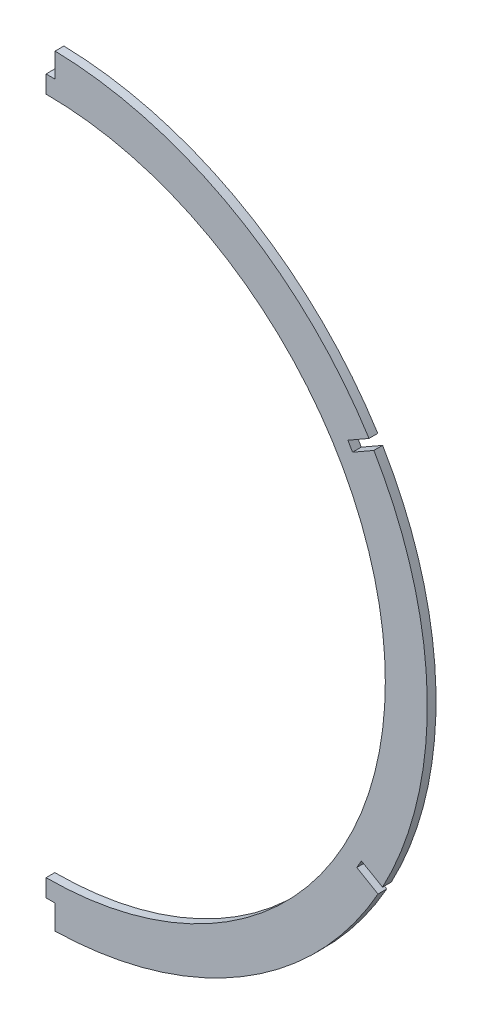
ISO-10303-21;
HEADER;
FILE_DESCRIPTION(('STEP AP214'),'2;1');
FILE_NAME('part.step','',(''),(''),'','','');
FILE_SCHEMA(('AUTOMOTIVE_DESIGN { 1 0 10303 214 1 1 1 1 }'));
ENDSEC;
DATA;
#1=APPLICATION_CONTEXT('core data for automotive mechanical design processes');
#2=APPLICATION_PROTOCOL_DEFINITION('international standard','automotive_design',2000,#1);
#3=PRODUCT_CONTEXT('',#1,'mechanical');
#4=PRODUCT('Part','Part','',(#3));
#5=PRODUCT_RELATED_PRODUCT_CATEGORY('part','',(#4));
#6=PRODUCT_DEFINITION_FORMATION('','',#4);
#7=PRODUCT_DEFINITION_CONTEXT('part definition',#1,'design');
#8=PRODUCT_DEFINITION('design','',#6,#7);
#9=PRODUCT_DEFINITION_SHAPE('','',#8);
#10=(LENGTH_UNIT() NAMED_UNIT(*) SI_UNIT(.MILLI.,.METRE.));
#11=(NAMED_UNIT(*) PLANE_ANGLE_UNIT() SI_UNIT($,.RADIAN.));
#12=(NAMED_UNIT(*) SI_UNIT($,.STERADIAN.) SOLID_ANGLE_UNIT());
#13=UNCERTAINTY_MEASURE_WITH_UNIT(LENGTH_MEASURE(1.E-05),#10,'distance_accuracy_value','');
#14=(GEOMETRIC_REPRESENTATION_CONTEXT(3) GLOBAL_UNCERTAINTY_ASSIGNED_CONTEXT((#13)) GLOBAL_UNIT_ASSIGNED_CONTEXT((#10,
#11,#12)) REPRESENTATION_CONTEXT('',''));
#15=CARTESIAN_POINT('',(0.,0.,0.));
#16=DIRECTION('',(0.,0.,1.));
#17=DIRECTION('',(1.,0.,0.));
#18=AXIS2_PLACEMENT_3D('',#15,#16,#17);
#19=CARTESIAN_POINT('',(0.,21.844,1.5875));
#20=DIRECTION('',(0.,0.,-1.));
#21=DIRECTION('',(-1.,0.,0.));
#22=AXIS2_PLACEMENT_3D('',#19,#20,#21);
#23=CYLINDRICAL_SURFACE('',#22,138.43);
#24=DIRECTION('',(0.,0.,-1.));
#25=VECTOR('',#24,1.);
#26=CARTESIAN_POINT('',(3.30200000000003,160.234612745229,1.58750000000002));
#27=LINE('',#26,#25);
#28=CARTESIAN_POINT('',(3.30200000000003,160.234612745229,1.58750000000002));
#29=VERTEX_POINT('',#28);
#30=CARTESIAN_POINT('',(3.30200000000003,160.234612745229,-1.5875));
#31=VERTEX_POINT('',#30);
#32=EDGE_CURVE('E177',#29,#31,#27,.T.);
#33=ORIENTED_EDGE('',*,*,#32,.F.);
#34=CARTESIAN_POINT('',(0.,21.844,1.5875));
#35=DIRECTION('',(0.,0.,1.));
#36=DIRECTION('',(1.,0.,0.));
#37=AXIS2_PLACEMENT_3D('',#34,#35,#36);
#38=CIRCLE('',#37,138.43);
#39=CARTESIAN_POINT('',(117.267867628689,95.4042618389861,1.58750000000002));
#40=VERTEX_POINT('',#39);
#41=EDGE_CURVE('E253',#40,#29,#38,.T.);
#42=ORIENTED_EDGE('',*,*,#41,.F.);
#43=DIRECTION('',(0.,0.,-1.));
#44=VECTOR('',#43,1.);
#45=CARTESIAN_POINT('',(117.267867628689,95.4042618389861,1.58750000000002));
#46=LINE('',#45,#44);
#47=CARTESIAN_POINT('',(117.267867628689,95.4042618389861,-1.5875));
#48=VERTEX_POINT('',#47);
#49=EDGE_CURVE('E154',#40,#48,#46,.T.);
#50=ORIENTED_EDGE('',*,*,#49,.T.);
#51=CARTESIAN_POINT('',(0.,21.844,-1.5875));
#52=DIRECTION('',(0.,0.,1.));
#53=DIRECTION('',(1.,0.,0.));
#54=AXIS2_PLACEMENT_3D('',#51,#52,#53);
#55=CIRCLE('',#54,138.43);
#56=EDGE_CURVE('E249',#48,#31,#55,.T.);
#57=ORIENTED_EDGE('',*,*,#56,.T.);
#58=EDGE_LOOP('',(#33,#42,#50,#57));
#59=FACE_BOUND('',#58,.T.);
#60=ADVANCED_FACE('F36',(#59),#23,.T.);
#61=DIRECTION('',(0.,0.,-1.));
#62=VECTOR('',#61,1.);
#63=CARTESIAN_POINT('',(119.028614444151,92.5196948569,1.58750000000002));
#64=LINE('',#63,#62);
#65=CARTESIAN_POINT('',(119.028614444151,92.5196948569,1.58750000000002));
#66=VERTEX_POINT('',#65);
#67=CARTESIAN_POINT('',(119.028614444151,92.5196948569,-1.5875));
#68=VERTEX_POINT('',#67);
#69=EDGE_CURVE('E181',#66,#68,#64,.T.);
#70=ORIENTED_EDGE('',*,*,#69,.F.);
#71=CARTESIAN_POINT('',(122.170481646894,-43.2500728036427,1.58750000000002));
#72=VERTEX_POINT('',#71);
#73=EDGE_CURVE('E255',#72,#66,#38,.T.);
#74=ORIENTED_EDGE('',*,*,#73,.F.);
#75=DIRECTION('',(0.,0.,-1.));
#76=VECTOR('',#75,1.);
#77=CARTESIAN_POINT('',(122.170481646894,-43.2500728036427,1.58750000000002));
#78=LINE('',#77,#76);
#79=CARTESIAN_POINT('',(122.170481646894,-43.2500728036427,-1.5875));
#80=VERTEX_POINT('',#79);
#81=EDGE_CURVE('E235',#72,#80,#78,.T.);
#82=ORIENTED_EDGE('',*,*,#81,.T.);
#83=EDGE_CURVE('E259',#80,#68,#55,.T.);
#84=ORIENTED_EDGE('',*,*,#83,.T.);
#85=EDGE_LOOP('',(#70,#74,#82,#84));
#86=FACE_BOUND('',#85,.T.);
#87=ADVANCED_FACE('F271',(#86),#23,.T.);
#88=CARTESIAN_POINT('',(3.30200000000003,-116.546612745229,1.58750000000002));
#89=VERTEX_POINT('',#88);
#90=CARTESIAN_POINT('',(120.545230583747,-46.2126843411516,1.58750000000002));
#91=VERTEX_POINT('',#90);
#92=EDGE_CURVE('E257',#89,#91,#38,.T.);
#93=ORIENTED_EDGE('',*,*,#92,.F.);
#94=DIRECTION('',(0.,0.,-1.));
#95=VECTOR('',#94,1.);
#96=CARTESIAN_POINT('',(3.30200000000003,-116.546612745229,1.58750000000002));
#97=LINE('',#96,#95);
#98=CARTESIAN_POINT('',(3.30200000000003,-116.546612745229,-1.5875));
#99=VERTEX_POINT('',#98);
#100=EDGE_CURVE('E213',#89,#99,#97,.T.);
#101=ORIENTED_EDGE('',*,*,#100,.T.);
#102=CARTESIAN_POINT('',(120.545230583747,-46.2126843411516,-1.5875));
#103=VERTEX_POINT('',#102);
#104=EDGE_CURVE('E256',#99,#103,#55,.T.);
#105=ORIENTED_EDGE('',*,*,#104,.T.);
#106=DIRECTION('',(0.,0.,-1.));
#107=VECTOR('',#106,1.);
#108=CARTESIAN_POINT('',(120.545230583747,-46.2126843411516,1.58750000000002));
#109=LINE('',#108,#107);
#110=EDGE_CURVE('E232',#91,#103,#109,.T.);
#111=ORIENTED_EDGE('',*,*,#110,.F.);
#112=EDGE_LOOP('',(#93,#101,#105,#111));
#113=FACE_BOUND('',#112,.T.);
#114=ADVANCED_FACE('F312',(#113),#23,.T.);
#115=CARTESIAN_POINT('',(0.,21.844,1.5875));
#116=DIRECTION('',(0.,0.,1.));
#117=DIRECTION('',(1.,0.,0.));
#118=AXIS2_PLACEMENT_3D('',#115,#116,#117);
#119=PLANE('',#118);
#120=DIRECTION('',(0.,1.,0.));
#121=VECTOR('',#120,1.);
#122=CARTESIAN_POINT('',(0.,21.844,1.5875));
#123=LINE('',#122,#121);
#124=CARTESIAN_POINT('',(0.,-107.696,1.5875));
#125=VERTEX_POINT('',#124);
#126=CARTESIAN_POINT('',(0.,-101.346,1.5875));
#127=VERTEX_POINT('',#126);
#128=EDGE_CURVE('E242',#125,#127,#123,.T.);
#129=ORIENTED_EDGE('',*,*,#128,.F.);
#130=DIRECTION('',(-1.,0.,0.));
#131=VECTOR('',#130,1.);
#132=CARTESIAN_POINT('',(0.,-107.696,1.58750000000002));
#133=LINE('',#132,#131);
#134=CARTESIAN_POINT('',(3.30200000000003,-107.696,1.58750000000002));
#135=VERTEX_POINT('',#134);
#136=EDGE_CURVE('E201',#135,#125,#133,.T.);
#137=ORIENTED_EDGE('',*,*,#136,.F.);
#138=DIRECTION('',(0.,-1.,0.));
#139=VECTOR('',#138,1.);
#140=CARTESIAN_POINT('',(3.30200000000003,0.,1.58750000000002));
#141=LINE('',#140,#139);
#142=EDGE_CURVE('E203',#135,#89,#141,.T.);
#143=ORIENTED_EDGE('',*,*,#142,.T.);
#144=ORIENTED_EDGE('',*,*,#92,.T.);
#145=DIRECTION('',(0.865224389921446,-0.501384837310684,0.));
#146=VECTOR('',#145,1.);
#147=CARTESIAN_POINT('',(10.2559317414635,17.6983459086641,1.58750000000002));
#148=LINE('',#147,#146);
#149=CARTESIAN_POINT('',(112.823974717501,-41.7383298714589,1.58750000000002));
#150=VERTEX_POINT('',#149);
#151=EDGE_CURVE('E217',#150,#91,#148,.T.);
#152=ORIENTED_EDGE('',*,*,#151,.F.);
#153=DIRECTION('',(0.501384837310677,0.865224389921451,0.));
#154=VECTOR('',#153,1.);
#155=CARTESIAN_POINT('',(102.568042976038,-59.4366757801223,1.58750000000002));
#156=LINE('',#155,#154);
#157=CARTESIAN_POINT('',(114.517752974904,-38.8154288374264,1.58750000000002));
#158=VERTEX_POINT('',#157);
#159=EDGE_CURVE('E219',#150,#158,#156,.T.);
#160=ORIENTED_EDGE('',*,*,#159,.T.);
#161=DIRECTION('',(0.865224389921462,-0.501384837310656,0.));
#162=VECTOR('',#161,1.);
#163=CARTESIAN_POINT('',(11.9497099988639,20.6212469426938,1.58750000000002));
#164=LINE('',#163,#162);
#165=EDGE_CURVE('E223',#158,#72,#164,.T.);
#166=ORIENTED_EDGE('',*,*,#165,.T.);
#167=ORIENTED_EDGE('',*,*,#73,.T.);
#168=DIRECTION('',(0.867621916047047,0.497224507435878,0.));
#169=VECTOR('',#168,1.);
#170=CARTESIAN_POINT('',(-10.4855553069629,18.2965590999507,1.58750000000002));
#171=LINE('',#170,#169);
#172=CARTESIAN_POINT('',(111.27822002931,88.0780296867635,1.58750000000002));
#173=VERTEX_POINT('',#172);
#174=EDGE_CURVE('E155',#173,#66,#171,.T.);
#175=ORIENTED_EDGE('',*,*,#174,.F.);
#176=DIRECTION('',(0.497224507435877,-0.867621916047047,0.));
#177=VECTOR('',#176,1.);
#178=CARTESIAN_POINT('',(121.763775336273,69.7814705868126,1.58750000000002));
#179=LINE('',#178,#177);
#180=CARTESIAN_POINT('',(109.598496198289,91.0090300435543,1.58750000000002));
#181=VERTEX_POINT('',#180);
#182=EDGE_CURVE('E150',#181,#173,#179,.T.);
#183=ORIENTED_EDGE('',*,*,#182,.F.);
#184=DIRECTION('',(0.867621916047047,0.497224507435877,0.));
#185=VECTOR('',#184,1.);
#186=CARTESIAN_POINT('',(-12.1652791379832,21.2275594567417,1.58750000000002));
#187=LINE('',#186,#185);
#188=EDGE_CURVE('E158',#181,#40,#187,.T.);
#189=ORIENTED_EDGE('',*,*,#188,.T.);
#190=ORIENTED_EDGE('',*,*,#41,.T.);
#191=DIRECTION('',(0.,1.,0.));
#192=VECTOR('',#191,1.);
#193=CARTESIAN_POINT('',(3.30200000000003,0.,1.58750000000002));
#194=LINE('',#193,#192);
#195=CARTESIAN_POINT('',(3.30200000000003,151.384,1.58750000000002));
#196=VERTEX_POINT('',#195);
#197=EDGE_CURVE('E184',#196,#29,#194,.T.);
#198=ORIENTED_EDGE('',*,*,#197,.F.);
#199=DIRECTION('',(-1.,0.,0.));
#200=VECTOR('',#199,1.);
#201=CARTESIAN_POINT('',(0.,151.384,1.58750000000002));
#202=LINE('',#201,#200);
#203=CARTESIAN_POINT('',(0.,151.384,1.58750000000002));
#204=VERTEX_POINT('',#203);
#205=EDGE_CURVE('E186',#196,#204,#202,.T.);
#206=ORIENTED_EDGE('',*,*,#205,.T.);
#207=CARTESIAN_POINT('',(0.,145.034,1.58750000000002));
#208=VERTEX_POINT('',#207);
#209=EDGE_CURVE('E245',#208,#204,#123,.T.);
#210=ORIENTED_EDGE('',*,*,#209,.F.);
#211=CARTESIAN_POINT('',(0.,21.844,1.5875));
#212=DIRECTION('',(0.,0.,1.));
#213=DIRECTION('',(1.,0.,0.));
#214=AXIS2_PLACEMENT_3D('',#211,#212,#213);
#215=CIRCLE('',#214,123.19);
#216=EDGE_CURVE('E250',#127,#208,#215,.T.);
#217=ORIENTED_EDGE('',*,*,#216,.F.);
#218=EDGE_LOOP('',(#129,#137,#143,#144,#152,#160,#166,#167,#175,#183,#189,#190,#198,#206,#210,#217));
#219=FACE_BOUND('',#218,.T.);
#220=ADVANCED_FACE('F167',(#219),#119,.T.);
#221=CARTESIAN_POINT('',(0.,21.844,-1.5875));
#222=DIRECTION('',(0.,0.,1.));
#223=DIRECTION('',(1.,0.,0.));
#224=AXIS2_PLACEMENT_3D('',#221,#222,#223);
#225=PLANE('',#224);
#226=DIRECTION('',(-1.,0.,0.));
#227=VECTOR('',#226,1.);
#228=CARTESIAN_POINT('',(0.,-107.696,-1.5875));
#229=LINE('',#228,#227);
#230=CARTESIAN_POINT('',(3.30200000000003,-107.696,-1.5875));
#231=VERTEX_POINT('',#230);
#232=CARTESIAN_POINT('',(0.,-107.696,-1.5875));
#233=VERTEX_POINT('',#232);
#234=EDGE_CURVE('E208',#231,#233,#229,.T.);
#235=ORIENTED_EDGE('',*,*,#234,.T.);
#236=DIRECTION('',(0.,1.,0.));
#237=VECTOR('',#236,1.);
#238=CARTESIAN_POINT('',(0.,21.844,-1.5875));
#239=LINE('',#238,#237);
#240=CARTESIAN_POINT('',(0.,-101.346,-1.58750000000002));
#241=VERTEX_POINT('',#240);
#242=EDGE_CURVE('E234',#233,#241,#239,.T.);
#243=ORIENTED_EDGE('',*,*,#242,.T.);
#244=CARTESIAN_POINT('',(0.,21.844,-1.58750000000002));
#245=DIRECTION('',(0.,0.,1.));
#246=DIRECTION('',(1.,0.,0.));
#247=AXIS2_PLACEMENT_3D('',#244,#245,#246);
#248=CIRCLE('',#247,123.19);
#249=CARTESIAN_POINT('',(0.,145.034,-1.58750000000002));
#250=VERTEX_POINT('',#249);
#251=EDGE_CURVE('E246',#250,#241,#248,.F.);
#252=ORIENTED_EDGE('',*,*,#251,.F.);
#253=CARTESIAN_POINT('',(0.,151.384,-1.5875));
#254=VERTEX_POINT('',#253);
#255=EDGE_CURVE('E243',#250,#254,#239,.T.);
#256=ORIENTED_EDGE('',*,*,#255,.T.);
#257=DIRECTION('',(-1.,0.,0.));
#258=VECTOR('',#257,1.);
#259=CARTESIAN_POINT('',(0.,151.384,-1.5875));
#260=LINE('',#259,#258);
#261=CARTESIAN_POINT('',(3.30200000000003,151.384,-1.5875));
#262=VERTEX_POINT('',#261);
#263=EDGE_CURVE('E187',#262,#254,#260,.T.);
#264=ORIENTED_EDGE('',*,*,#263,.F.);
#265=DIRECTION('',(0.,1.,0.));
#266=VECTOR('',#265,1.);
#267=CARTESIAN_POINT('',(3.30200000000003,0.,-1.5875));
#268=LINE('',#267,#266);
#269=EDGE_CURVE('E191',#262,#31,#268,.T.);
#270=ORIENTED_EDGE('',*,*,#269,.T.);
#271=ORIENTED_EDGE('',*,*,#56,.F.);
#272=DIRECTION('',(0.867621916047047,0.497224507435877,0.));
#273=VECTOR('',#272,1.);
#274=CARTESIAN_POINT('',(-12.1652791379832,21.2275594567417,-1.5875));
#275=LINE('',#274,#273);
#276=CARTESIAN_POINT('',(109.598496198289,91.0090300435543,-1.5875));
#277=VERTEX_POINT('',#276);
#278=EDGE_CURVE('E172',#277,#48,#275,.T.);
#279=ORIENTED_EDGE('',*,*,#278,.F.);
#280=DIRECTION('',(0.497224507435877,-0.867621916047047,0.));
#281=VECTOR('',#280,1.);
#282=CARTESIAN_POINT('',(121.763775336273,69.7814705868126,-1.5875));
#283=LINE('',#282,#281);
#284=CARTESIAN_POINT('',(111.27822002931,88.0780296867635,-1.5875));
#285=VERTEX_POINT('',#284);
#286=EDGE_CURVE('E50',#277,#285,#283,.T.);
#287=ORIENTED_EDGE('',*,*,#286,.T.);
#288=DIRECTION('',(0.867621916047047,0.497224507435878,0.));
#289=VECTOR('',#288,1.);
#290=CARTESIAN_POINT('',(-10.4855553069629,18.2965590999507,-1.5875));
#291=LINE('',#290,#289);
#292=EDGE_CURVE('E169',#285,#68,#291,.T.);
#293=ORIENTED_EDGE('',*,*,#292,.T.);
#294=ORIENTED_EDGE('',*,*,#83,.F.);
#295=DIRECTION('',(0.865224389921462,-0.501384837310656,0.));
#296=VECTOR('',#295,1.);
#297=CARTESIAN_POINT('',(11.9497099988639,20.6212469426938,-1.5875));
#298=LINE('',#297,#296);
#299=CARTESIAN_POINT('',(114.517752974904,-38.8154288374264,-1.5875));
#300=VERTEX_POINT('',#299);
#301=EDGE_CURVE('E220',#300,#80,#298,.T.);
#302=ORIENTED_EDGE('',*,*,#301,.F.);
#303=DIRECTION('',(0.501384837310677,0.865224389921451,0.));
#304=VECTOR('',#303,1.);
#305=CARTESIAN_POINT('',(102.568042976038,-59.4366757801223,-1.5875));
#306=LINE('',#305,#304);
#307=CARTESIAN_POINT('',(112.823974717501,-41.7383298714589,-1.5875));
#308=VERTEX_POINT('',#307);
#309=EDGE_CURVE('E228',#308,#300,#306,.T.);
#310=ORIENTED_EDGE('',*,*,#309,.F.);
#311=DIRECTION('',(0.865224389921446,-0.501384837310684,0.));
#312=VECTOR('',#311,1.);
#313=CARTESIAN_POINT('',(10.2559317414635,17.6983459086641,-1.5875));
#314=LINE('',#313,#312);
#315=EDGE_CURVE('E58',#308,#103,#314,.T.);
#316=ORIENTED_EDGE('',*,*,#315,.T.);
#317=ORIENTED_EDGE('',*,*,#104,.F.);
#318=DIRECTION('',(0.,-1.,0.));
#319=VECTOR('',#318,1.);
#320=CARTESIAN_POINT('',(3.30200000000003,0.,-1.5875));
#321=LINE('',#320,#319);
#322=EDGE_CURVE('E204',#231,#99,#321,.T.);
#323=ORIENTED_EDGE('',*,*,#322,.F.);
#324=EDGE_LOOP('',(#235,#243,#252,#256,#264,#270,#271,#279,#287,#293,#294,#302,#310,#316,#317,#323));
#325=FACE_BOUND('',#324,.T.);
#326=ADVANCED_FACE('F277',(#325),#225,.F.);
#327=CARTESIAN_POINT('',(0.,0.,0.));
#328=DIRECTION('',(1.,0.,0.));
#329=DIRECTION('',(0.,0.,-1.));
#330=AXIS2_PLACEMENT_3D('',#327,#328,#329);
#331=PLANE('',#330);
#332=DIRECTION('',(0.,0.,-1.));
#333=VECTOR('',#332,1.);
#334=CARTESIAN_POINT('',(0.,-107.696,1.58750000000002));
#335=LINE('',#334,#333);
#336=EDGE_CURVE('E194',#125,#233,#335,.T.);
#337=ORIENTED_EDGE('',*,*,#336,.F.);
#338=ORIENTED_EDGE('',*,*,#128,.T.);
#339=DIRECTION('',(0.,0.,1.));
#340=VECTOR('',#339,1.);
#341=CARTESIAN_POINT('',(0.,-101.346,-350.021437497483));
#342=LINE('',#341,#340);
#343=EDGE_CURVE('E43',#241,#127,#342,.T.);
#344=ORIENTED_EDGE('',*,*,#343,.F.);
#345=ORIENTED_EDGE('',*,*,#242,.F.);
#346=EDGE_LOOP('',(#337,#338,#344,#345));
#347=FACE_BOUND('',#346,.T.);
#348=ADVANCED_FACE('F301',(#347),#331,.F.);
#349=CARTESIAN_POINT('',(0.,21.844,-350.021437497483));
#350=DIRECTION('',(0.,0.,1.));
#351=DIRECTION('',(1.,0.,0.));
#352=AXIS2_PLACEMENT_3D('',#349,#350,#351);
#353=CYLINDRICAL_SURFACE('',#352,123.19);
#354=ORIENTED_EDGE('',*,*,#216,.T.);
#355=DIRECTION('',(0.,0.,1.));
#356=VECTOR('',#355,1.);
#357=CARTESIAN_POINT('',(0.,145.034,-350.021437497483));
#358=LINE('',#357,#356);
#359=EDGE_CURVE('E11',#208,#250,#358,.F.);
#360=ORIENTED_EDGE('',*,*,#359,.T.);
#361=ORIENTED_EDGE('',*,*,#251,.T.);
#362=ORIENTED_EDGE('',*,*,#343,.T.);
#363=EDGE_LOOP('',(#354,#360,#361,#362));
#364=FACE_BOUND('',#363,.T.);
#365=ADVANCED_FACE('F297',(#364),#353,.F.);
#366=ORIENTED_EDGE('',*,*,#209,.T.);
#367=DIRECTION('',(0.,0.,-1.));
#368=VECTOR('',#367,1.);
#369=CARTESIAN_POINT('',(0.,151.384,1.58750000000002));
#370=LINE('',#369,#368);
#371=EDGE_CURVE('E197',#204,#254,#370,.T.);
#372=ORIENTED_EDGE('',*,*,#371,.T.);
#373=ORIENTED_EDGE('',*,*,#255,.F.);
#374=ORIENTED_EDGE('',*,*,#359,.F.);
#375=EDGE_LOOP('',(#366,#372,#373,#374));
#376=FACE_BOUND('',#375,.T.);
#377=ADVANCED_FACE('F294',(#376),#331,.F.);
#378=CARTESIAN_POINT('',(3.30200000000003,0.,1.58750000000002));
#379=DIRECTION('',(-1.,0.,0.));
#380=DIRECTION('',(0.,0.,1.));
#381=AXIS2_PLACEMENT_3D('',#378,#379,#380);
#382=PLANE('',#381);
#383=ORIENTED_EDGE('',*,*,#269,.F.);
#384=DIRECTION('',(0.,0.,-1.));
#385=VECTOR('',#384,1.);
#386=CARTESIAN_POINT('',(3.30200000000003,151.384,1.58750000000002));
#387=LINE('',#386,#385);
#388=EDGE_CURVE('E190',#196,#262,#387,.T.);
#389=ORIENTED_EDGE('',*,*,#388,.F.);
#390=ORIENTED_EDGE('',*,*,#197,.T.);
#391=ORIENTED_EDGE('',*,*,#32,.T.);
#392=EDGE_LOOP('',(#383,#389,#390,#391));
#393=FACE_BOUND('',#392,.T.);
#394=ADVANCED_FACE('F288',(#393),#382,.T.);
#395=CARTESIAN_POINT('',(0.,151.384,1.58750000000002));
#396=DIRECTION('',(0.,-1.,0.));
#397=DIRECTION('',(0.,0.,-1.));
#398=AXIS2_PLACEMENT_3D('',#395,#396,#397);
#399=PLANE('',#398);
#400=ORIENTED_EDGE('',*,*,#263,.T.);
#401=ORIENTED_EDGE('',*,*,#371,.F.);
#402=ORIENTED_EDGE('',*,*,#205,.F.);
#403=ORIENTED_EDGE('',*,*,#388,.T.);
#404=EDGE_LOOP('',(#400,#401,#402,#403));
#405=FACE_BOUND('',#404,.T.);
#406=ADVANCED_FACE('F291',(#405),#399,.F.);
#407=CARTESIAN_POINT('',(0.,-107.696,1.58750000000002));
#408=DIRECTION('',(0.,-1.,0.));
#409=DIRECTION('',(0.,0.,-1.));
#410=AXIS2_PLACEMENT_3D('',#407,#408,#409);
#411=PLANE('',#410);
#412=ORIENTED_EDGE('',*,*,#234,.F.);
#413=DIRECTION('',(0.,0.,-1.));
#414=VECTOR('',#413,1.);
#415=CARTESIAN_POINT('',(3.30200000000003,-107.696,1.58750000000002));
#416=LINE('',#415,#414);
#417=EDGE_CURVE('E207',#135,#231,#416,.T.);
#418=ORIENTED_EDGE('',*,*,#417,.F.);
#419=ORIENTED_EDGE('',*,*,#136,.T.);
#420=ORIENTED_EDGE('',*,*,#336,.T.);
#421=EDGE_LOOP('',(#412,#418,#419,#420));
#422=FACE_BOUND('',#421,.T.);
#423=ADVANCED_FACE('F304',(#422),#411,.T.);
#424=CARTESIAN_POINT('',(3.30200000000003,0.,1.58750000000002));
#425=DIRECTION('',(1.,0.,0.));
#426=DIRECTION('',(0.,0.,-1.));
#427=AXIS2_PLACEMENT_3D('',#424,#425,#426);
#428=PLANE('',#427);
#429=ORIENTED_EDGE('',*,*,#322,.T.);
#430=ORIENTED_EDGE('',*,*,#100,.F.);
#431=ORIENTED_EDGE('',*,*,#142,.F.);
#432=ORIENTED_EDGE('',*,*,#417,.T.);
#433=EDGE_LOOP('',(#429,#430,#431,#432));
#434=FACE_BOUND('',#433,.T.);
#435=ADVANCED_FACE('F309',(#434),#428,.F.);
#436=CARTESIAN_POINT('',(10.2559317414635,17.6983459086641,1.58750000000002));
#437=DIRECTION('',(0.501384837310684,0.865224389921446,0.));
#438=DIRECTION('',(-0.865224389921446,0.501384837310684,0.));
#439=AXIS2_PLACEMENT_3D('',#436,#437,#438);
#440=PLANE('',#439);
#441=ORIENTED_EDGE('',*,*,#315,.F.);
#442=DIRECTION('',(0.,0.,-1.));
#443=VECTOR('',#442,1.);
#444=CARTESIAN_POINT('',(112.823974717501,-41.7383298714589,1.58750000000002));
#445=LINE('',#444,#443);
#446=EDGE_CURVE('E226',#150,#308,#445,.T.);
#447=ORIENTED_EDGE('',*,*,#446,.F.);
#448=ORIENTED_EDGE('',*,*,#151,.T.);
#449=ORIENTED_EDGE('',*,*,#110,.T.);
#450=EDGE_LOOP('',(#441,#447,#448,#449));
#451=FACE_BOUND('',#450,.T.);
#452=ADVANCED_FACE('F314',(#451),#440,.T.);
#453=CARTESIAN_POINT('',(11.9497099988639,20.6212469426938,1.58750000000002));
#454=DIRECTION('',(0.501384837310656,0.865224389921462,0.));
#455=DIRECTION('',(-0.865224389921462,0.501384837310656,0.));
#456=AXIS2_PLACEMENT_3D('',#453,#454,#455);
#457=PLANE('',#456);
#458=ORIENTED_EDGE('',*,*,#301,.T.);
#459=ORIENTED_EDGE('',*,*,#81,.F.);
#460=ORIENTED_EDGE('',*,*,#165,.F.);
#461=DIRECTION('',(0.,0.,-1.));
#462=VECTOR('',#461,1.);
#463=CARTESIAN_POINT('',(114.517752974904,-38.8154288374264,1.58750000000002));
#464=LINE('',#463,#462);
#465=EDGE_CURVE('E238',#158,#300,#464,.T.);
#466=ORIENTED_EDGE('',*,*,#465,.T.);
#467=EDGE_LOOP('',(#458,#459,#460,#466));
#468=FACE_BOUND('',#467,.T.);
#469=ADVANCED_FACE('F320',(#468),#457,.F.);
#470=CARTESIAN_POINT('',(102.568042976038,-59.4366757801223,1.58750000000002));
#471=DIRECTION('',(-0.865224389921451,0.501384837310676,0.));
#472=DIRECTION('',(-0.501384837310676,-0.865224389921451,0.));
#473=AXIS2_PLACEMENT_3D('',#470,#471,#472);
#474=PLANE('',#473);
#475=ORIENTED_EDGE('',*,*,#309,.T.);
#476=ORIENTED_EDGE('',*,*,#465,.F.);
#477=ORIENTED_EDGE('',*,*,#159,.F.);
#478=ORIENTED_EDGE('',*,*,#446,.T.);
#479=EDGE_LOOP('',(#475,#476,#477,#478));
#480=FACE_BOUND('',#479,.T.);
#481=ADVANCED_FACE('F317',(#480),#474,.F.);
#482=CARTESIAN_POINT('',(121.763775336273,69.7814705868126,1.58750000000002));
#483=DIRECTION('',(0.867621916047047,0.497224507435877,0.));
#484=DIRECTION('',(-0.497224507435877,0.867621916047047,0.));
#485=AXIS2_PLACEMENT_3D('',#482,#483,#484);
#486=PLANE('',#485);
#487=ORIENTED_EDGE('',*,*,#286,.F.);
#488=DIRECTION('',(0.,0.,-1.));
#489=VECTOR('',#488,1.);
#490=CARTESIAN_POINT('',(109.598496198289,91.0090300435543,1.58750000000002));
#491=LINE('',#490,#489);
#492=EDGE_CURVE('E146',#181,#277,#491,.T.);
#493=ORIENTED_EDGE('',*,*,#492,.F.);
#494=ORIENTED_EDGE('',*,*,#182,.T.);
#495=DIRECTION('',(0.,0.,-1.));
#496=VECTOR('',#495,1.);
#497=CARTESIAN_POINT('',(111.27822002931,88.0780296867635,1.58750000000002));
#498=LINE('',#497,#496);
#499=EDGE_CURVE('E179',#173,#285,#498,.T.);
#500=ORIENTED_EDGE('',*,*,#499,.T.);
#501=EDGE_LOOP('',(#487,#493,#494,#500));
#502=FACE_BOUND('',#501,.T.);
#503=ADVANCED_FACE('F148',(#502),#486,.T.);
#504=CARTESIAN_POINT('',(-10.4855553069629,18.2965590999507,1.58750000000002));
#505=DIRECTION('',(-0.497224507435878,0.867621916047046,0.));
#506=DIRECTION('',(-0.867621916047047,-0.497224507435878,0.));
#507=AXIS2_PLACEMENT_3D('',#504,#505,#506);
#508=PLANE('',#507);
#509=ORIENTED_EDGE('',*,*,#292,.F.);
#510=ORIENTED_EDGE('',*,*,#499,.F.);
#511=ORIENTED_EDGE('',*,*,#174,.T.);
#512=ORIENTED_EDGE('',*,*,#69,.T.);
#513=EDGE_LOOP('',(#509,#510,#511,#512));
#514=FACE_BOUND('',#513,.T.);
#515=ADVANCED_FACE('F275',(#514),#508,.T.);
#516=CARTESIAN_POINT('',(-12.1652791379832,21.2275594567417,1.58750000000002));
#517=DIRECTION('',(-0.497224507435877,0.867621916047047,0.));
#518=DIRECTION('',(-0.867621916047047,-0.497224507435877,0.));
#519=AXIS2_PLACEMENT_3D('',#516,#517,#518);
#520=PLANE('',#519);
#521=ORIENTED_EDGE('',*,*,#278,.T.);
#522=ORIENTED_EDGE('',*,*,#49,.F.);
#523=ORIENTED_EDGE('',*,*,#188,.F.);
#524=ORIENTED_EDGE('',*,*,#492,.T.);
#525=EDGE_LOOP('',(#521,#522,#523,#524));
#526=FACE_BOUND('',#525,.T.);
#527=ADVANCED_FACE('F159',(#526),#520,.F.);
#528=CLOSED_SHELL('',(#60,#87,#114,#220,#326,#348,#365,#377,#394,#406,#423,#435,#452,#469,#481,
#503,#515,#527));
#529=MANIFOLD_SOLID_BREP('B2',#528);
#530=ADVANCED_BREP_SHAPE_REPRESENTATION('',(#18,#529),#14);
#531=SHAPE_DEFINITION_REPRESENTATION(#9,#530);
ENDSEC;
END-ISO-10303-21;
